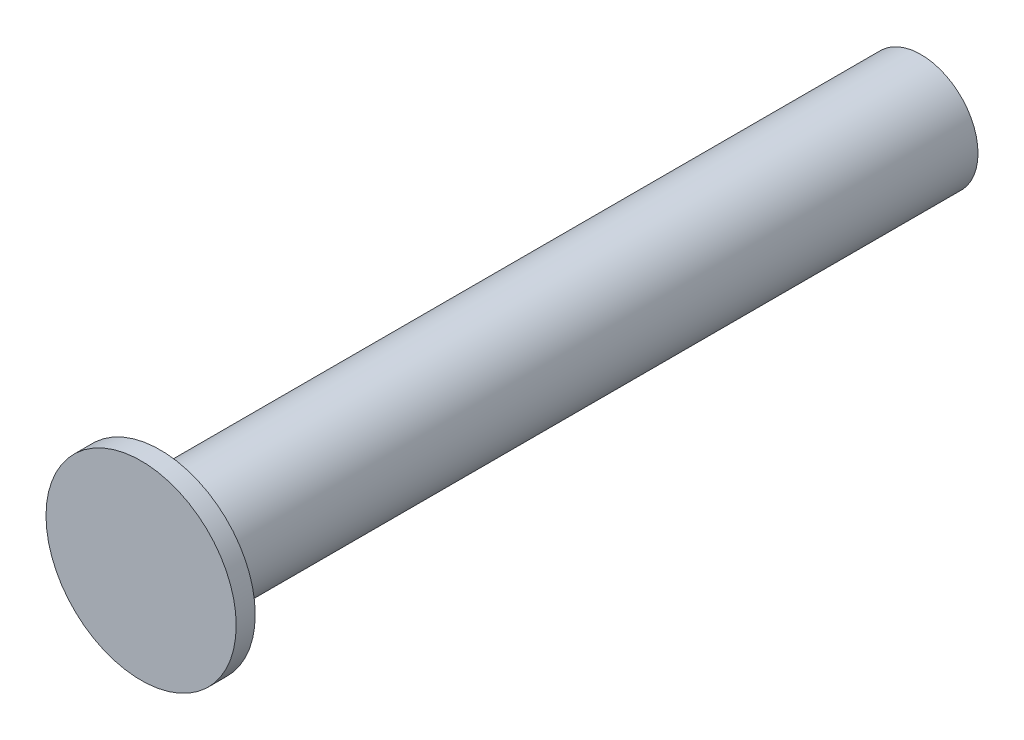
ISO-10303-21;
HEADER;
FILE_DESCRIPTION(('STEP AP214'),'2;1');
FILE_NAME('part.step','',(''),(''),'','','');
FILE_SCHEMA(('AUTOMOTIVE_DESIGN { 1 0 10303 214 1 1 1 1 }'));
ENDSEC;
DATA;
#1=APPLICATION_CONTEXT('core data for automotive mechanical design processes');
#2=APPLICATION_PROTOCOL_DEFINITION('international standard','automotive_design',2000,#1);
#3=PRODUCT_CONTEXT('',#1,'mechanical');
#4=PRODUCT('Part','Part','',(#3));
#5=PRODUCT_RELATED_PRODUCT_CATEGORY('part','',(#4));
#6=PRODUCT_DEFINITION_FORMATION('','',#4);
#7=PRODUCT_DEFINITION_CONTEXT('part definition',#1,'design');
#8=PRODUCT_DEFINITION('design','',#6,#7);
#9=PRODUCT_DEFINITION_SHAPE('','',#8);
#10=(LENGTH_UNIT() NAMED_UNIT(*) SI_UNIT(.MILLI.,.METRE.));
#11=(NAMED_UNIT(*) PLANE_ANGLE_UNIT() SI_UNIT($,.RADIAN.));
#12=(NAMED_UNIT(*) SI_UNIT($,.STERADIAN.) SOLID_ANGLE_UNIT());
#13=UNCERTAINTY_MEASURE_WITH_UNIT(LENGTH_MEASURE(1.E-05),#10,'distance_accuracy_value','');
#14=(GEOMETRIC_REPRESENTATION_CONTEXT(3) GLOBAL_UNCERTAINTY_ASSIGNED_CONTEXT((#13)) GLOBAL_UNIT_ASSIGNED_CONTEXT((#10,
#11,#12)) REPRESENTATION_CONTEXT('',''));
#15=CARTESIAN_POINT('',(0.,0.,0.));
#16=DIRECTION('',(0.,0.,1.));
#17=DIRECTION('',(1.,0.,0.));
#18=AXIS2_PLACEMENT_3D('',#15,#16,#17);
#19=CARTESIAN_POINT('',(0.,0.,4.));
#20=DIRECTION('',(0.,0.,-1.));
#21=DIRECTION('',(-1.,0.,0.));
#22=AXIS2_PLACEMENT_3D('',#19,#20,#21);
#23=CYLINDRICAL_SURFACE('',#22,0.3);
#24=CARTESIAN_POINT('',(0.,0.,4.));
#25=DIRECTION('',(0.,0.,1.));
#26=DIRECTION('',(1.,0.,0.));
#27=AXIS2_PLACEMENT_3D('',#24,#25,#26);
#28=CIRCLE('',#27,0.3);
#29=CARTESIAN_POINT('',(0.3,0.,4.));
#30=VERTEX_POINT('',#29);
#31=EDGE_CURVE('E10',#30,#30,#28,.T.);
#32=ORIENTED_EDGE('',*,*,#31,.F.);
#33=EDGE_LOOP('',(#32));
#34=FACE_BOUND('',#33,.T.);
#35=CARTESIAN_POINT('',(0.,0.,0.));
#36=DIRECTION('',(0.,0.,1.));
#37=DIRECTION('',(1.,0.,0.));
#38=AXIS2_PLACEMENT_3D('',#35,#36,#37);
#39=CIRCLE('',#38,0.3);
#40=CARTESIAN_POINT('',(0.3,0.,0.));
#41=VERTEX_POINT('',#40);
#42=EDGE_CURVE('E35',#41,#41,#39,.T.);
#43=ORIENTED_EDGE('',*,*,#42,.T.);
#44=EDGE_LOOP('',(#43));
#45=FACE_BOUND('',#44,.T.);
#46=ADVANCED_FACE('F32',(#34,#45),#23,.T.);
#47=CARTESIAN_POINT('',(0.,0.,0.));
#48=DIRECTION('',(0.,0.,1.));
#49=DIRECTION('',(1.,0.,0.));
#50=AXIS2_PLACEMENT_3D('',#47,#48,#49);
#51=PLANE('',#50);
#52=ORIENTED_EDGE('',*,*,#42,.F.);
#53=EDGE_LOOP('',(#52));
#54=FACE_BOUND('',#53,.T.);
#55=ADVANCED_FACE('F55',(#54),#51,.F.);
#56=CARTESIAN_POINT('',(0.,0.,4.1));
#57=DIRECTION('',(0.,0.,-1.));
#58=DIRECTION('',(-1.,0.,0.));
#59=AXIS2_PLACEMENT_3D('',#56,#57,#58);
#60=CYLINDRICAL_SURFACE('',#59,0.5);
#61=CARTESIAN_POINT('',(0.,0.,4.1));
#62=DIRECTION('',(0.,0.,1.));
#63=DIRECTION('',(1.,0.,0.));
#64=AXIS2_PLACEMENT_3D('',#61,#62,#63);
#65=CIRCLE('',#64,0.5);
#66=CARTESIAN_POINT('',(0.5,0.,4.1));
#67=VERTEX_POINT('',#66);
#68=EDGE_CURVE('E42',#67,#67,#65,.T.);
#69=ORIENTED_EDGE('',*,*,#68,.F.);
#70=EDGE_LOOP('',(#69));
#71=FACE_BOUND('',#70,.T.);
#72=CARTESIAN_POINT('',(0.,0.,4.));
#73=DIRECTION('',(0.,0.,1.));
#74=DIRECTION('',(1.,0.,0.));
#75=AXIS2_PLACEMENT_3D('',#72,#73,#74);
#76=CIRCLE('',#75,0.5);
#77=CARTESIAN_POINT('',(0.5,0.,4.));
#78=VERTEX_POINT('',#77);
#79=EDGE_CURVE('E44',#78,#78,#76,.T.);
#80=ORIENTED_EDGE('',*,*,#79,.T.);
#81=EDGE_LOOP('',(#80));
#82=FACE_BOUND('',#81,.T.);
#83=ADVANCED_FACE('F52',(#71,#82),#60,.T.);
#84=CARTESIAN_POINT('',(0.,0.,4.1));
#85=DIRECTION('',(0.,0.,1.));
#86=DIRECTION('',(1.,0.,0.));
#87=AXIS2_PLACEMENT_3D('',#84,#85,#86);
#88=PLANE('',#87);
#89=ORIENTED_EDGE('',*,*,#68,.T.);
#90=EDGE_LOOP('',(#89));
#91=FACE_BOUND('',#90,.T.);
#92=ADVANCED_FACE('F50',(#91),#88,.T.);
#93=CARTESIAN_POINT('',(0.,0.,4.));
#94=DIRECTION('',(0.,0.,1.));
#95=DIRECTION('',(1.,0.,0.));
#96=AXIS2_PLACEMENT_3D('',#93,#94,#95);
#97=PLANE('',#96);
#98=ORIENTED_EDGE('',*,*,#31,.T.);
#99=EDGE_LOOP('',(#98));
#100=FACE_BOUND('',#99,.T.);
#101=ORIENTED_EDGE('',*,*,#79,.F.);
#102=EDGE_LOOP('',(#101));
#103=FACE_BOUND('',#102,.T.);
#104=ADVANCED_FACE('F59',(#100,#103),#97,.F.);
#105=CLOSED_SHELL('',(#46,#55,#83,#92,#104));
#106=MANIFOLD_SOLID_BREP('B2',#105);
#107=ADVANCED_BREP_SHAPE_REPRESENTATION('',(#18,#106),#14);
#108=SHAPE_DEFINITION_REPRESENTATION(#9,#107);
ENDSEC;
END-ISO-10303-21;
